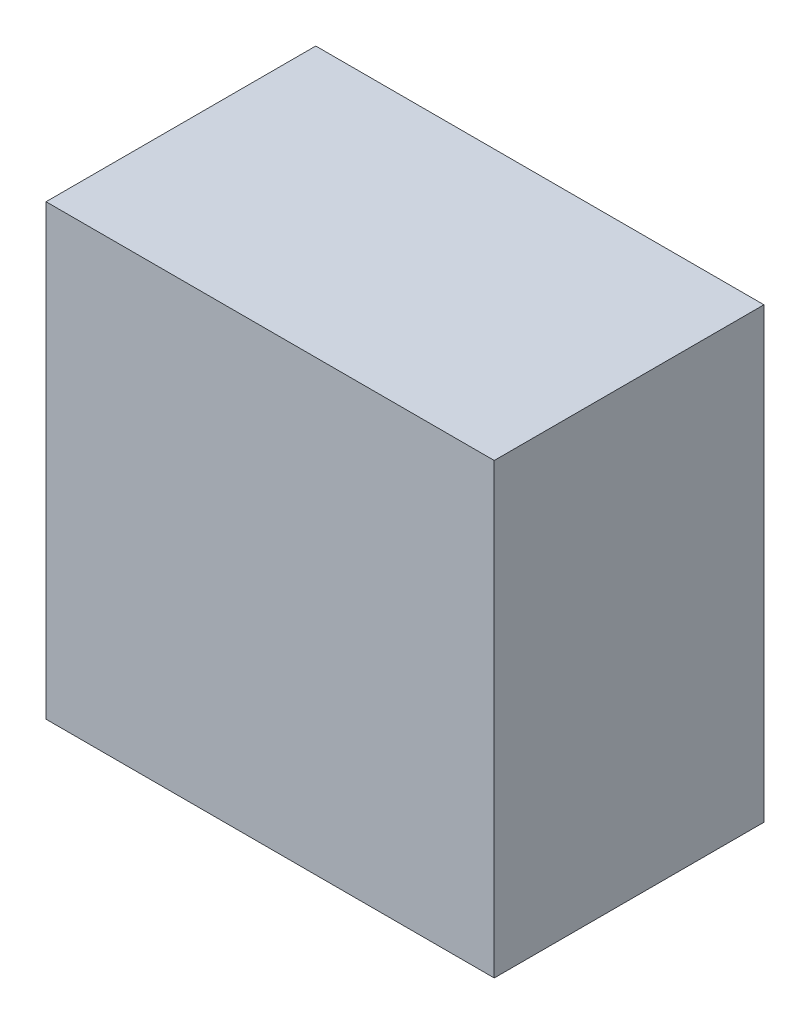
ISO-10303-21;
HEADER;
FILE_DESCRIPTION(('STEP AP214'),'2;1');
FILE_NAME('part.step','',(''),(''),'','','');
FILE_SCHEMA(('AUTOMOTIVE_DESIGN { 1 0 10303 214 1 1 1 1 }'));
ENDSEC;
DATA;
#1=APPLICATION_CONTEXT('core data for automotive mechanical design processes');
#2=APPLICATION_PROTOCOL_DEFINITION('international standard','automotive_design',2000,#1);
#3=PRODUCT_CONTEXT('',#1,'mechanical');
#4=PRODUCT('Part','Part','',(#3));
#5=PRODUCT_RELATED_PRODUCT_CATEGORY('part','',(#4));
#6=PRODUCT_DEFINITION_FORMATION('','',#4);
#7=PRODUCT_DEFINITION_CONTEXT('part definition',#1,'design');
#8=PRODUCT_DEFINITION('design','',#6,#7);
#9=PRODUCT_DEFINITION_SHAPE('','',#8);
#10=(LENGTH_UNIT() NAMED_UNIT(*) SI_UNIT(.MILLI.,.METRE.));
#11=(NAMED_UNIT(*) PLANE_ANGLE_UNIT() SI_UNIT($,.RADIAN.));
#12=(NAMED_UNIT(*) SI_UNIT($,.STERADIAN.) SOLID_ANGLE_UNIT());
#13=UNCERTAINTY_MEASURE_WITH_UNIT(LENGTH_MEASURE(1.E-05),#10,'distance_accuracy_value','');
#14=(GEOMETRIC_REPRESENTATION_CONTEXT(3) GLOBAL_UNCERTAINTY_ASSIGNED_CONTEXT((#13)) GLOBAL_UNIT_ASSIGNED_CONTEXT((#10,
#11,#12)) REPRESENTATION_CONTEXT('',''));
#15=CARTESIAN_POINT('',(0.,0.,0.));
#16=DIRECTION('',(0.,0.,1.));
#17=DIRECTION('',(1.,0.,0.));
#18=AXIS2_PLACEMENT_3D('',#15,#16,#17);
#19=CARTESIAN_POINT('',(-2.99949108,2.99949108,3.6100004));
#20=DIRECTION('',(0.,0.,1.));
#21=DIRECTION('',(1.,0.,0.));
#22=AXIS2_PLACEMENT_3D('',#19,#20,#21);
#23=PLANE('',#22);
#24=DIRECTION('',(0.,1.,0.));
#25=VECTOR('',#24,1.);
#26=CARTESIAN_POINT('',(2.99949108,2.99949108,3.6100004));
#27=LINE('',#26,#25);
#28=CARTESIAN_POINT('',(2.99949108,2.99949108,3.6100004));
#29=VERTEX_POINT('',#28);
#30=CARTESIAN_POINT('',(2.99949108,-2.99949108,3.6100004));
#31=VERTEX_POINT('',#30);
#32=EDGE_CURVE('E53',#29,#31,#27,.F.);
#33=ORIENTED_EDGE('',*,*,#32,.F.);
#34=DIRECTION('',(1.,0.,0.));
#35=VECTOR('',#34,1.);
#36=CARTESIAN_POINT('',(-2.99949108,2.99949108,3.6100004));
#37=LINE('',#36,#35);
#38=CARTESIAN_POINT('',(-2.99949108,2.99949108,3.6100004));
#39=VERTEX_POINT('',#38);
#40=EDGE_CURVE('E68',#39,#29,#37,.T.);
#41=ORIENTED_EDGE('',*,*,#40,.F.);
#42=DIRECTION('',(0.,1.,0.));
#43=VECTOR('',#42,1.);
#44=CARTESIAN_POINT('',(-2.99949108,-2.99949108,3.6100004));
#45=LINE('',#44,#43);
#46=CARTESIAN_POINT('',(-2.99949108,-2.99949108,3.6100004));
#47=VERTEX_POINT('',#46);
#48=EDGE_CURVE('E20',#47,#39,#45,.T.);
#49=ORIENTED_EDGE('',*,*,#48,.F.);
#50=DIRECTION('',(1.,0.,0.));
#51=VECTOR('',#50,1.);
#52=CARTESIAN_POINT('',(2.99949108,-2.99949108,3.6100004));
#53=LINE('',#52,#51);
#54=EDGE_CURVE('E58',#31,#47,#53,.F.);
#55=ORIENTED_EDGE('',*,*,#54,.F.);
#56=EDGE_LOOP('',(#33,#41,#49,#55));
#57=FACE_BOUND('',#56,.T.);
#58=ADVANCED_FACE('F17',(#57),#23,.T.);
#59=CARTESIAN_POINT('',(-2.99949108,-2.99949108,0.));
#60=DIRECTION('',(-1.,0.,0.));
#61=DIRECTION('',(0.,0.,1.));
#62=AXIS2_PLACEMENT_3D('',#59,#60,#61);
#63=PLANE('',#62);
#64=DIRECTION('',(0.,0.,1.));
#65=VECTOR('',#64,1.);
#66=CARTESIAN_POINT('',(-2.99949108,2.99949108,0.));
#67=LINE('',#66,#65);
#68=CARTESIAN_POINT('',(-2.99949108,2.99949108,0.));
#69=VERTEX_POINT('',#68);
#70=EDGE_CURVE('E79',#69,#39,#67,.T.);
#71=ORIENTED_EDGE('',*,*,#70,.F.);
#72=DIRECTION('',(0.,1.,0.));
#73=VECTOR('',#72,1.);
#74=CARTESIAN_POINT('',(-2.99949108,2.99949108,0.));
#75=LINE('',#74,#73);
#76=CARTESIAN_POINT('',(-2.99949108,-2.99949108,0.));
#77=VERTEX_POINT('',#76);
#78=EDGE_CURVE('E74',#69,#77,#75,.F.);
#79=ORIENTED_EDGE('',*,*,#78,.T.);
#80=DIRECTION('',(0.,0.,-1.));
#81=VECTOR('',#80,1.);
#82=CARTESIAN_POINT('',(-2.99949108,-2.99949108,0.));
#83=LINE('',#82,#81);
#84=EDGE_CURVE('E63',#47,#77,#83,.T.);
#85=ORIENTED_EDGE('',*,*,#84,.F.);
#86=ORIENTED_EDGE('',*,*,#48,.T.);
#87=EDGE_LOOP('',(#71,#79,#85,#86));
#88=FACE_BOUND('',#87,.T.);
#89=ADVANCED_FACE('F73',(#88),#63,.T.);
#90=CARTESIAN_POINT('',(2.99949108,-2.99949108,0.));
#91=DIRECTION('',(0.,-1.,0.));
#92=DIRECTION('',(0.,0.,-1.));
#93=AXIS2_PLACEMENT_3D('',#90,#91,#92);
#94=PLANE('',#93);
#95=ORIENTED_EDGE('',*,*,#84,.T.);
#96=DIRECTION('',(1.,0.,0.));
#97=VECTOR('',#96,1.);
#98=CARTESIAN_POINT('',(-2.99949108,-2.99949108,0.));
#99=LINE('',#98,#97);
#100=CARTESIAN_POINT('',(2.99949108,-2.99949108,0.));
#101=VERTEX_POINT('',#100);
#102=EDGE_CURVE('E84',#77,#101,#99,.T.);
#103=ORIENTED_EDGE('',*,*,#102,.T.);
#104=DIRECTION('',(0.,0.,-1.));
#105=VECTOR('',#104,1.);
#106=CARTESIAN_POINT('',(2.99949108,-2.99949108,0.));
#107=LINE('',#106,#105);
#108=EDGE_CURVE('E65',#31,#101,#107,.T.);
#109=ORIENTED_EDGE('',*,*,#108,.F.);
#110=ORIENTED_EDGE('',*,*,#54,.T.);
#111=EDGE_LOOP('',(#95,#103,#109,#110));
#112=FACE_BOUND('',#111,.T.);
#113=ADVANCED_FACE('F60',(#112),#94,.T.);
#114=CARTESIAN_POINT('',(2.99949108,2.99949108,0.));
#115=DIRECTION('',(1.,0.,0.));
#116=DIRECTION('',(0.,0.,-1.));
#117=AXIS2_PLACEMENT_3D('',#114,#115,#116);
#118=PLANE('',#117);
#119=ORIENTED_EDGE('',*,*,#108,.T.);
#120=DIRECTION('',(0.,1.,0.));
#121=VECTOR('',#120,1.);
#122=CARTESIAN_POINT('',(2.99949108,2.99949108,0.));
#123=LINE('',#122,#121);
#124=CARTESIAN_POINT('',(2.99949108,2.99949108,0.));
#125=VERTEX_POINT('',#124);
#126=EDGE_CURVE('E26',#101,#125,#123,.T.);
#127=ORIENTED_EDGE('',*,*,#126,.T.);
#128=DIRECTION('',(0.,0.,1.));
#129=VECTOR('',#128,1.);
#130=CARTESIAN_POINT('',(2.99949108,2.99949108,0.));
#131=LINE('',#130,#129);
#132=EDGE_CURVE('E34',#29,#125,#131,.F.);
#133=ORIENTED_EDGE('',*,*,#132,.F.);
#134=ORIENTED_EDGE('',*,*,#32,.T.);
#135=EDGE_LOOP('',(#119,#127,#133,#134));
#136=FACE_BOUND('',#135,.T.);
#137=ADVANCED_FACE('F88',(#136),#118,.T.);
#138=CARTESIAN_POINT('',(-2.99949108,2.99949108,0.));
#139=DIRECTION('',(0.,1.,0.));
#140=DIRECTION('',(0.,0.,1.));
#141=AXIS2_PLACEMENT_3D('',#138,#139,#140);
#142=PLANE('',#141);
#143=ORIENTED_EDGE('',*,*,#132,.T.);
#144=DIRECTION('',(1.,0.,0.));
#145=VECTOR('',#144,1.);
#146=CARTESIAN_POINT('',(-2.99949108,2.99949108,0.));
#147=LINE('',#146,#145);
#148=EDGE_CURVE('E11',#125,#69,#147,.F.);
#149=ORIENTED_EDGE('',*,*,#148,.T.);
#150=ORIENTED_EDGE('',*,*,#70,.T.);
#151=ORIENTED_EDGE('',*,*,#40,.T.);
#152=EDGE_LOOP('',(#143,#149,#150,#151));
#153=FACE_BOUND('',#152,.T.);
#154=ADVANCED_FACE('F91',(#153),#142,.T.);
#155=CARTESIAN_POINT('',(-2.99949108,2.99949108,0.));
#156=DIRECTION('',(0.,0.,1.));
#157=DIRECTION('',(1.,0.,0.));
#158=AXIS2_PLACEMENT_3D('',#155,#156,#157);
#159=PLANE('',#158);
#160=ORIENTED_EDGE('',*,*,#126,.F.);
#161=ORIENTED_EDGE('',*,*,#102,.F.);
#162=ORIENTED_EDGE('',*,*,#78,.F.);
#163=ORIENTED_EDGE('',*,*,#148,.F.);
#164=EDGE_LOOP('',(#160,#161,#162,#163));
#165=FACE_BOUND('',#164,.T.);
#166=ADVANCED_FACE('F90',(#165),#159,.F.);
#167=CLOSED_SHELL('',(#58,#89,#113,#137,#154,#166));
#168=MANIFOLD_SOLID_BREP('B1',#167);
#169=ADVANCED_BREP_SHAPE_REPRESENTATION('',(#18,#168),#14);
#170=SHAPE_DEFINITION_REPRESENTATION(#9,#169);
ENDSEC;
END-ISO-10303-21;
